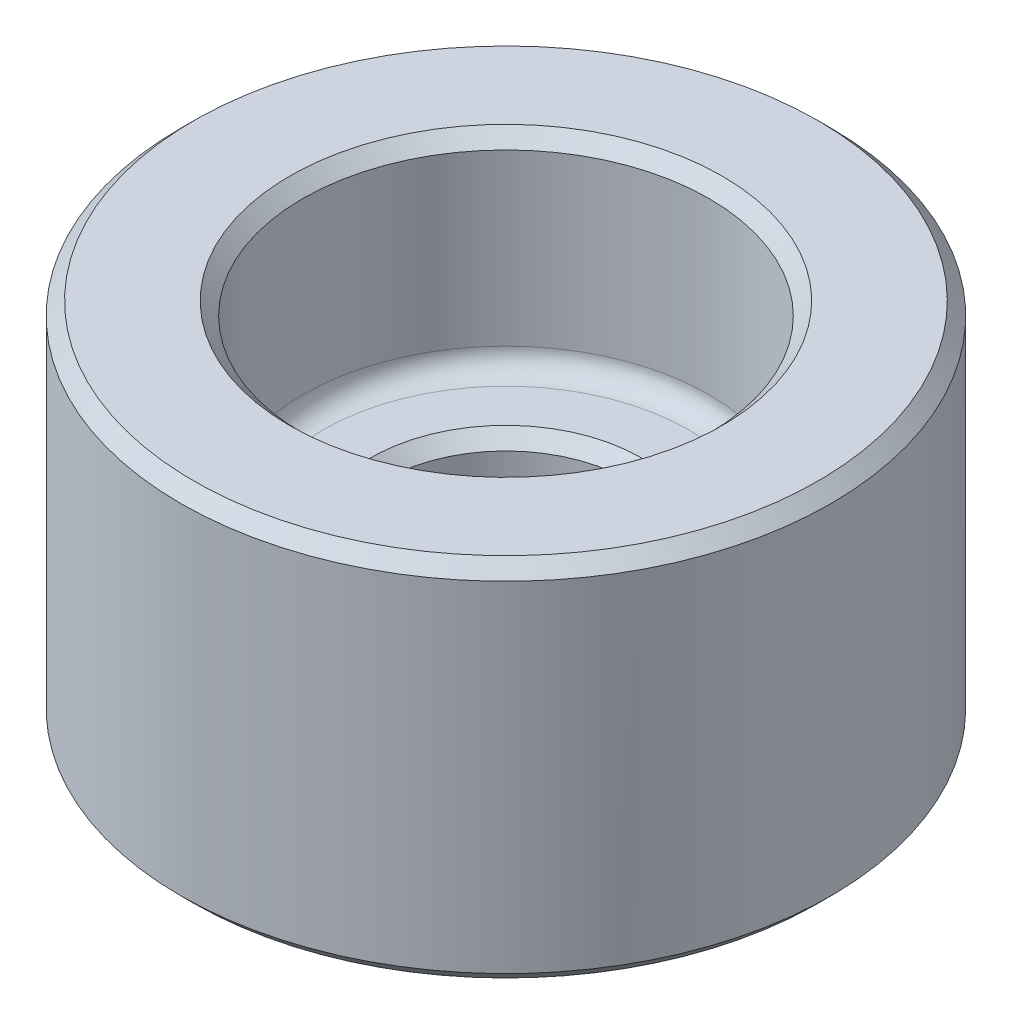
ISO-10303-21;
HEADER;
FILE_DESCRIPTION(('STEP AP214'),'2;1');
FILE_NAME('part.step','',(''),(''),'','','');
FILE_SCHEMA(('AUTOMOTIVE_DESIGN { 1 0 10303 214 1 1 1 1 }'));
ENDSEC;
DATA;
#1=APPLICATION_CONTEXT('core data for automotive mechanical design processes');
#2=APPLICATION_PROTOCOL_DEFINITION('international standard','automotive_design',2000,#1);
#3=PRODUCT_CONTEXT('',#1,'mechanical');
#4=PRODUCT('Part','Part','',(#3));
#5=PRODUCT_RELATED_PRODUCT_CATEGORY('part','',(#4));
#6=PRODUCT_DEFINITION_FORMATION('','',#4);
#7=PRODUCT_DEFINITION_CONTEXT('part definition',#1,'design');
#8=PRODUCT_DEFINITION('design','',#6,#7);
#9=PRODUCT_DEFINITION_SHAPE('','',#8);
#10=(LENGTH_UNIT() NAMED_UNIT(*) SI_UNIT(.MILLI.,.METRE.));
#11=(NAMED_UNIT(*) PLANE_ANGLE_UNIT() SI_UNIT($,.RADIAN.));
#12=(NAMED_UNIT(*) SI_UNIT($,.STERADIAN.) SOLID_ANGLE_UNIT());
#13=UNCERTAINTY_MEASURE_WITH_UNIT(LENGTH_MEASURE(1.E-05),#10,'distance_accuracy_value','');
#14=(GEOMETRIC_REPRESENTATION_CONTEXT(3) GLOBAL_UNCERTAINTY_ASSIGNED_CONTEXT((#13)) GLOBAL_UNIT_ASSIGNED_CONTEXT((#10,
#11,#12)) REPRESENTATION_CONTEXT('',''));
#15=CARTESIAN_POINT('',(0.,0.,0.));
#16=DIRECTION('',(0.,0.,1.));
#17=DIRECTION('',(1.,0.,0.));
#18=AXIS2_PLACEMENT_3D('',#15,#16,#17);
#19=CARTESIAN_POINT('',(6.35,0.,0.));
#20=DIRECTION('',(0.,1.,0.));
#21=DIRECTION('',(0.,0.,1.));
#22=AXIS2_PLACEMENT_3D('',#19,#20,#21);
#23=PLANE('',#22);
#24=CARTESIAN_POINT('',(0.,0.,0.));
#25=DIRECTION('',(0.,1.,0.));
#26=DIRECTION('',(0.,0.,1.));
#27=AXIS2_PLACEMENT_3D('',#24,#25,#26);
#28=CIRCLE('',#27,6.096);
#29=CARTESIAN_POINT('',(0.,0.,6.096));
#30=VERTEX_POINT('',#29);
#31=EDGE_CURVE('E45',#30,#30,#28,.F.);
#32=ORIENTED_EDGE('',*,*,#31,.T.);
#33=EDGE_LOOP('',(#32));
#34=FACE_BOUND('',#33,.T.);
#35=CARTESIAN_POINT('',(0.,0.,0.));
#36=DIRECTION('',(0.,1.,0.));
#37=DIRECTION('',(0.,0.,1.));
#38=AXIS2_PLACEMENT_3D('',#35,#36,#37);
#39=CIRCLE('',#38,2.63524999999999);
#40=CARTESIAN_POINT('',(0.,0.,2.63524999999999));
#41=VERTEX_POINT('',#40);
#42=EDGE_CURVE('E50',#41,#41,#39,.T.);
#43=ORIENTED_EDGE('',*,*,#42,.T.);
#44=EDGE_LOOP('',(#43));
#45=FACE_BOUND('',#44,.T.);
#46=ADVANCED_FACE('F30',(#34,#45),#23,.F.);
#47=CARTESIAN_POINT('',(0.,0.,0.));
#48=DIRECTION('',(0.,1.,0.));
#49=DIRECTION('',(0.,0.,1.));
#50=AXIS2_PLACEMENT_3D('',#47,#48,#49);
#51=CYLINDRICAL_SURFACE('',#50,2.38125);
#52=CARTESIAN_POINT('',(0.,2.921,0.));
#53=DIRECTION('',(0.,-1.,0.));
#54=DIRECTION('',(0.,0.,-1.));
#55=AXIS2_PLACEMENT_3D('',#52,#53,#54);
#56=CIRCLE('',#55,2.38125);
#57=CARTESIAN_POINT('',(0.,2.921,-2.38125));
#58=VERTEX_POINT('',#57);
#59=EDGE_CURVE('E37',#58,#58,#56,.F.);
#60=ORIENTED_EDGE('',*,*,#59,.T.);
#61=EDGE_LOOP('',(#60));
#62=FACE_BOUND('',#61,.T.);
#63=CARTESIAN_POINT('',(0.,0.253999999999993,0.));
#64=DIRECTION('',(0.,1.,0.));
#65=DIRECTION('',(0.,0.,1.));
#66=AXIS2_PLACEMENT_3D('',#63,#64,#65);
#67=CIRCLE('',#66,2.38125);
#68=CARTESIAN_POINT('',(0.,0.253999999999993,2.38125));
#69=VERTEX_POINT('',#68);
#70=EDGE_CURVE('E41',#69,#69,#67,.F.);
#71=ORIENTED_EDGE('',*,*,#70,.T.);
#72=EDGE_LOOP('',(#71));
#73=FACE_BOUND('',#72,.T.);
#74=ADVANCED_FACE('F96',(#62,#73),#51,.F.);
#75=CARTESIAN_POINT('',(2.38125,3.175,0.));
#76=DIRECTION('',(0.,-1.,0.));
#77=DIRECTION('',(0.,0.,-1.));
#78=AXIS2_PLACEMENT_3D('',#75,#76,#77);
#79=PLANE('',#78);
#80=CARTESIAN_POINT('',(0.,3.175,0.));
#81=DIRECTION('',(0.,-1.,0.));
#82=DIRECTION('',(0.,0.,-1.));
#83=AXIS2_PLACEMENT_3D('',#80,#81,#82);
#84=CIRCLE('',#83,2.63525);
#85=CARTESIAN_POINT('',(0.,3.175,-2.63525));
#86=VERTEX_POINT('',#85);
#87=EDGE_CURVE('E10',#86,#86,#84,.T.);
#88=ORIENTED_EDGE('',*,*,#87,.T.);
#89=EDGE_LOOP('',(#88));
#90=FACE_BOUND('',#89,.T.);
#91=CARTESIAN_POINT('',(0.,3.175,0.));
#92=DIRECTION('',(0.,-1.,0.));
#93=DIRECTION('',(0.,0.,-1.));
#94=AXIS2_PLACEMENT_3D('',#91,#92,#93);
#95=CIRCLE('',#94,3.571875);
#96=CARTESIAN_POINT('',(0.,3.175,-3.571875));
#97=VERTEX_POINT('',#96);
#98=EDGE_CURVE('E71',#97,#97,#95,.F.);
#99=ORIENTED_EDGE('',*,*,#98,.T.);
#100=EDGE_LOOP('',(#99));
#101=FACE_BOUND('',#100,.T.);
#102=ADVANCED_FACE('F75',(#90,#101),#79,.F.);
#103=CARTESIAN_POINT('',(0.,0.,0.));
#104=DIRECTION('',(0.,1.,0.));
#105=DIRECTION('',(0.,0.,1.));
#106=AXIS2_PLACEMENT_3D('',#103,#104,#105);
#107=CYLINDRICAL_SURFACE('',#106,3.96875);
#108=CARTESIAN_POINT('',(0.,6.88975,0.));
#109=DIRECTION('',(0.,-1.,0.));
#110=DIRECTION('',(0.,0.,-1.));
#111=AXIS2_PLACEMENT_3D('',#108,#109,#110);
#112=CIRCLE('',#111,3.96875);
#113=CARTESIAN_POINT('',(0.,6.88975,-3.96875));
#114=VERTEX_POINT('',#113);
#115=EDGE_CURVE('E65',#114,#114,#112,.F.);
#116=ORIENTED_EDGE('',*,*,#115,.T.);
#117=EDGE_LOOP('',(#116));
#118=FACE_BOUND('',#117,.T.);
#119=CARTESIAN_POINT('',(0.,3.571875,0.));
#120=DIRECTION('',(0.,-1.,0.));
#121=DIRECTION('',(0.,0.,-1.));
#122=AXIS2_PLACEMENT_3D('',#119,#120,#121);
#123=CIRCLE('',#122,3.96875);
#124=CARTESIAN_POINT('',(0.,3.571875,-3.96875));
#125=VERTEX_POINT('',#124);
#126=EDGE_CURVE('E68',#125,#125,#123,.T.);
#127=ORIENTED_EDGE('',*,*,#126,.T.);
#128=EDGE_LOOP('',(#127));
#129=FACE_BOUND('',#128,.T.);
#130=ADVANCED_FACE('F106',(#118,#129),#107,.F.);
#131=CARTESIAN_POINT('',(3.96875,7.14375,0.));
#132=DIRECTION('',(0.,-1.,0.));
#133=DIRECTION('',(0.,0.,-1.));
#134=AXIS2_PLACEMENT_3D('',#131,#132,#133);
#135=PLANE('',#134);
#136=CARTESIAN_POINT('',(0.,7.14375,0.));
#137=DIRECTION('',(0.,-1.,0.));
#138=DIRECTION('',(0.,0.,-1.));
#139=AXIS2_PLACEMENT_3D('',#136,#137,#138);
#140=CIRCLE('',#139,4.22275);
#141=CARTESIAN_POINT('',(0.,7.14375,-4.22275));
#142=VERTEX_POINT('',#141);
#143=EDGE_CURVE('E59',#142,#142,#140,.T.);
#144=ORIENTED_EDGE('',*,*,#143,.T.);
#145=EDGE_LOOP('',(#144));
#146=FACE_BOUND('',#145,.T.);
#147=CARTESIAN_POINT('',(0.,7.14375,0.));
#148=DIRECTION('',(0.,-1.,0.));
#149=DIRECTION('',(0.,0.,-1.));
#150=AXIS2_PLACEMENT_3D('',#147,#148,#149);
#151=CIRCLE('',#150,6.096);
#152=CARTESIAN_POINT('',(0.,7.14375,-6.096));
#153=VERTEX_POINT('',#152);
#154=EDGE_CURVE('E62',#153,#153,#151,.F.);
#155=ORIENTED_EDGE('',*,*,#154,.T.);
#156=EDGE_LOOP('',(#155));
#157=FACE_BOUND('',#156,.T.);
#158=ADVANCED_FACE('F90',(#146,#157),#135,.F.);
#159=CARTESIAN_POINT('',(0.,0.,0.));
#160=DIRECTION('',(0.,1.,0.));
#161=DIRECTION('',(0.,0.,1.));
#162=AXIS2_PLACEMENT_3D('',#159,#160,#161);
#163=CYLINDRICAL_SURFACE('',#162,6.35);
#164=CARTESIAN_POINT('',(0.,0.254000000000002,0.));
#165=DIRECTION('',(0.,1.,0.));
#166=DIRECTION('',(0.,0.,1.));
#167=AXIS2_PLACEMENT_3D('',#164,#165,#166);
#168=CIRCLE('',#167,6.35);
#169=CARTESIAN_POINT('',(0.,0.254000000000002,6.35));
#170=VERTEX_POINT('',#169);
#171=EDGE_CURVE('E53',#170,#170,#168,.T.);
#172=ORIENTED_EDGE('',*,*,#171,.T.);
#173=EDGE_LOOP('',(#172));
#174=FACE_BOUND('',#173,.T.);
#175=CARTESIAN_POINT('',(0.,6.88975,0.));
#176=DIRECTION('',(0.,-1.,0.));
#177=DIRECTION('',(0.,0.,-1.));
#178=AXIS2_PLACEMENT_3D('',#175,#176,#177);
#179=CIRCLE('',#178,6.35);
#180=CARTESIAN_POINT('',(0.,6.88975,-6.35));
#181=VERTEX_POINT('',#180);
#182=EDGE_CURVE('E56',#181,#181,#179,.T.);
#183=ORIENTED_EDGE('',*,*,#182,.T.);
#184=EDGE_LOOP('',(#183));
#185=FACE_BOUND('',#184,.T.);
#186=ADVANCED_FACE('F80',(#174,#185),#163,.T.);
#187=CARTESIAN_POINT('',(0.,3.571875,0.));
#188=DIRECTION('',(0.,-1.,0.));
#189=DIRECTION('',(0.,0.,-1.));
#190=AXIS2_PLACEMENT_3D('',#187,#188,#189);
#191=TOROIDAL_SURFACE('',#190,3.571875,0.396875);
#192=ORIENTED_EDGE('',*,*,#126,.F.);
#193=EDGE_LOOP('',(#192));
#194=FACE_BOUND('',#193,.T.);
#195=ORIENTED_EDGE('',*,*,#98,.F.);
#196=EDGE_LOOP('',(#195));
#197=FACE_BOUND('',#196,.T.);
#198=ADVANCED_FACE('F77',(#194,#197),#191,.F.);
#199=CARTESIAN_POINT('',(0.,6.88975,0.));
#200=DIRECTION('',(0.,1.,0.));
#201=DIRECTION('',(0.,0.,1.));
#202=AXIS2_PLACEMENT_3D('',#199,#200,#201);
#203=CONICAL_SURFACE('',#202,3.96875,0.785398163397448);
#204=ORIENTED_EDGE('',*,*,#143,.F.);
#205=EDGE_LOOP('',(#204));
#206=FACE_BOUND('',#205,.T.);
#207=ORIENTED_EDGE('',*,*,#115,.F.);
#208=EDGE_LOOP('',(#207));
#209=FACE_BOUND('',#208,.T.);
#210=ADVANCED_FACE('F79',(#206,#209),#203,.F.);
#211=CARTESIAN_POINT('',(0.,0.254000000000002,0.));
#212=DIRECTION('',(0.,1.,0.));
#213=DIRECTION('',(0.,0.,1.));
#214=AXIS2_PLACEMENT_3D('',#211,#212,#213);
#215=CONICAL_SURFACE('',#214,6.35,0.785398163397447);
#216=ORIENTED_EDGE('',*,*,#31,.F.);
#217=EDGE_LOOP('',(#216));
#218=FACE_BOUND('',#217,.T.);
#219=ORIENTED_EDGE('',*,*,#171,.F.);
#220=EDGE_LOOP('',(#219));
#221=FACE_BOUND('',#220,.T.);
#222=ADVANCED_FACE('F87',(#218,#221),#215,.T.);
#223=CARTESIAN_POINT('',(0.,7.14375,0.));
#224=DIRECTION('',(0.,-1.,0.));
#225=DIRECTION('',(0.,0.,-1.));
#226=AXIS2_PLACEMENT_3D('',#223,#224,#225);
#227=CONICAL_SURFACE('',#226,6.096,0.785398163397448);
#228=ORIENTED_EDGE('',*,*,#182,.F.);
#229=EDGE_LOOP('',(#228));
#230=FACE_BOUND('',#229,.T.);
#231=ORIENTED_EDGE('',*,*,#154,.F.);
#232=EDGE_LOOP('',(#231));
#233=FACE_BOUND('',#232,.T.);
#234=ADVANCED_FACE('F118',(#230,#233),#227,.T.);
#235=CARTESIAN_POINT('',(0.,2.921,0.));
#236=DIRECTION('',(0.,1.,0.));
#237=DIRECTION('',(0.,0.,1.));
#238=AXIS2_PLACEMENT_3D('',#235,#236,#237);
#239=CONICAL_SURFACE('',#238,2.38125,0.785398163397452);
#240=ORIENTED_EDGE('',*,*,#87,.F.);
#241=EDGE_LOOP('',(#240));
#242=FACE_BOUND('',#241,.T.);
#243=ORIENTED_EDGE('',*,*,#59,.F.);
#244=EDGE_LOOP('',(#243));
#245=FACE_BOUND('',#244,.T.);
#246=ADVANCED_FACE('F120',(#242,#245),#239,.F.);
#247=CARTESIAN_POINT('',(0.,0.,0.));
#248=DIRECTION('',(0.,-1.,0.));
#249=DIRECTION('',(0.,0.,-1.));
#250=AXIS2_PLACEMENT_3D('',#247,#248,#249);
#251=CONICAL_SURFACE('',#250,2.63524999999999,0.785398163397448);
#252=ORIENTED_EDGE('',*,*,#70,.F.);
#253=EDGE_LOOP('',(#252));
#254=FACE_BOUND('',#253,.T.);
#255=ORIENTED_EDGE('',*,*,#42,.F.);
#256=EDGE_LOOP('',(#255));
#257=FACE_BOUND('',#256,.T.);
#258=ADVANCED_FACE('F32',(#254,#257),#251,.F.);
#259=CLOSED_SHELL('',(#46,#74,#102,#130,#158,#186,#198,#210,#222,#234,#246,#258));
#260=MANIFOLD_SOLID_BREP('B2',#259);
#261=ADVANCED_BREP_SHAPE_REPRESENTATION('',(#18,#260),#14);
#262=SHAPE_DEFINITION_REPRESENTATION(#9,#261);
ENDSEC;
END-ISO-10303-21;
